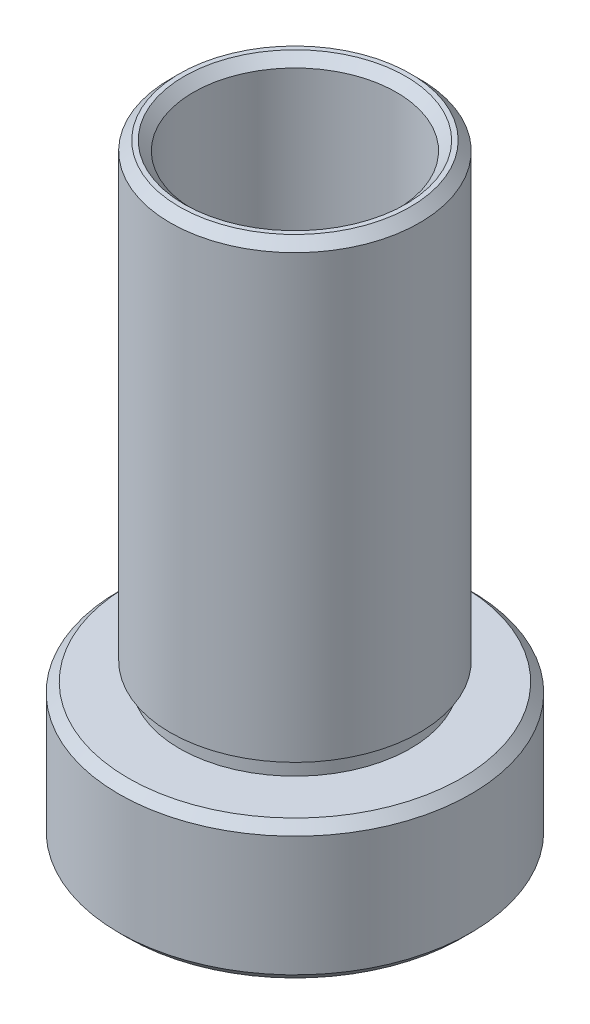
ISO-10303-21;
HEADER;
FILE_DESCRIPTION(('STEP AP214'),'2;1');
FILE_NAME('part.step','',(''),(''),'','','');
FILE_SCHEMA(('AUTOMOTIVE_DESIGN { 1 0 10303 214 1 1 1 1 }'));
ENDSEC;
DATA;
#1=APPLICATION_CONTEXT('core data for automotive mechanical design processes');
#2=APPLICATION_PROTOCOL_DEFINITION('international standard','automotive_design',2000,#1);
#3=PRODUCT_CONTEXT('',#1,'mechanical');
#4=PRODUCT('Part','Part','',(#3));
#5=PRODUCT_RELATED_PRODUCT_CATEGORY('part','',(#4));
#6=PRODUCT_DEFINITION_FORMATION('','',#4);
#7=PRODUCT_DEFINITION_CONTEXT('part definition',#1,'design');
#8=PRODUCT_DEFINITION('design','',#6,#7);
#9=PRODUCT_DEFINITION_SHAPE('','',#8);
#10=(LENGTH_UNIT() NAMED_UNIT(*) SI_UNIT(.MILLI.,.METRE.));
#11=(NAMED_UNIT(*) PLANE_ANGLE_UNIT() SI_UNIT($,.RADIAN.));
#12=(NAMED_UNIT(*) SI_UNIT($,.STERADIAN.) SOLID_ANGLE_UNIT());
#13=UNCERTAINTY_MEASURE_WITH_UNIT(LENGTH_MEASURE(1.E-05),#10,'distance_accuracy_value','');
#14=(GEOMETRIC_REPRESENTATION_CONTEXT(3) GLOBAL_UNCERTAINTY_ASSIGNED_CONTEXT((#13)) GLOBAL_UNIT_ASSIGNED_CONTEXT((#10,
#11,#12)) REPRESENTATION_CONTEXT('',''));
#15=CARTESIAN_POINT('',(0.,0.,0.));
#16=DIRECTION('',(0.,0.,1.));
#17=DIRECTION('',(1.,0.,0.));
#18=AXIS2_PLACEMENT_3D('',#15,#16,#17);
#19=CARTESIAN_POINT('',(6.75,2.64285417456689,0.));
#20=DIRECTION('',(0.,1.,0.));
#21=DIRECTION('',(0.,0.,1.));
#22=AXIS2_PLACEMENT_3D('',#19,#20,#21);
#23=PLANE('',#22);
#24=CARTESIAN_POINT('',(0.,2.6428541745669,0.));
#25=DIRECTION('',(0.,1.,0.));
#26=DIRECTION('',(0.,0.,1.));
#27=AXIS2_PLACEMENT_3D('',#24,#25,#26);
#28=CIRCLE('',#27,6.75);
#29=CARTESIAN_POINT('',(0.,2.6428541745669,6.75));
#30=VERTEX_POINT('',#29);
#31=EDGE_CURVE('E10',#30,#30,#28,.T.);
#32=ORIENTED_EDGE('',*,*,#31,.F.);
#33=EDGE_LOOP('',(#32));
#34=FACE_BOUND('',#33,.T.);
#35=CARTESIAN_POINT('',(0.,2.6428541745669,0.));
#36=DIRECTION('',(0.,1.,0.));
#37=DIRECTION('',(0.,0.,1.));
#38=AXIS2_PLACEMENT_3D('',#35,#36,#37);
#39=CIRCLE('',#38,6.25000000000001);
#40=CARTESIAN_POINT('',(0.,2.6428541745669,6.25000000000001));
#41=VERTEX_POINT('',#40);
#42=EDGE_CURVE('E94',#41,#41,#39,.T.);
#43=ORIENTED_EDGE('',*,*,#42,.T.);
#44=EDGE_LOOP('',(#43));
#45=FACE_BOUND('',#44,.T.);
#46=ADVANCED_FACE('F39',(#34,#45),#23,.F.);
#47=CARTESIAN_POINT('',(0.,44.5985977452931,0.));
#48=DIRECTION('',(0.,1.,0.));
#49=DIRECTION('',(0.,0.,1.));
#50=AXIS2_PLACEMENT_3D('',#47,#48,#49);
#51=CYLINDRICAL_SURFACE('',#50,6.75);
#52=CARTESIAN_POINT('',(0.,26.5428541745669,0.));
#53=DIRECTION('',(0.,1.,0.));
#54=DIRECTION('',(0.,0.,1.));
#55=AXIS2_PLACEMENT_3D('',#52,#53,#54);
#56=CIRCLE('',#55,6.75);
#57=CARTESIAN_POINT('',(0.,26.5428541745669,6.75));
#58=VERTEX_POINT('',#57);
#59=EDGE_CURVE('E45',#58,#58,#56,.T.);
#60=ORIENTED_EDGE('',*,*,#59,.F.);
#61=EDGE_LOOP('',(#60));
#62=FACE_BOUND('',#61,.T.);
#63=ORIENTED_EDGE('',*,*,#31,.T.);
#64=EDGE_LOOP('',(#63));
#65=FACE_BOUND('',#64,.T.);
#66=ADVANCED_FACE('F185',(#62,#65),#51,.T.);
#67=CARTESIAN_POINT('',(0.,26.5428541745669,0.));
#68=DIRECTION('',(0.,-1.,0.));
#69=DIRECTION('',(0.,0.,-1.));
#70=AXIS2_PLACEMENT_3D('',#67,#68,#69);
#71=CONICAL_SURFACE('',#70,6.75,0.785398163397445);
#72=CARTESIAN_POINT('',(0.,27.0428541745669,0.));
#73=DIRECTION('',(0.,1.,0.));
#74=DIRECTION('',(0.,0.,1.));
#75=AXIS2_PLACEMENT_3D('',#72,#73,#74);
#76=CIRCLE('',#75,6.25);
#77=CARTESIAN_POINT('',(0.,27.0428541745669,6.25));
#78=VERTEX_POINT('',#77);
#79=EDGE_CURVE('E49',#78,#78,#76,.T.);
#80=ORIENTED_EDGE('',*,*,#79,.F.);
#81=EDGE_LOOP('',(#80));
#82=FACE_BOUND('',#81,.T.);
#83=ORIENTED_EDGE('',*,*,#59,.T.);
#84=EDGE_LOOP('',(#83));
#85=FACE_BOUND('',#84,.T.);
#86=ADVANCED_FACE('F180',(#82,#85),#71,.T.);
#87=CARTESIAN_POINT('',(6.00000000000001,27.0428541745669,0.));
#88=DIRECTION('',(0.,-1.,0.));
#89=DIRECTION('',(0.,0.,-1.));
#90=AXIS2_PLACEMENT_3D('',#87,#88,#89);
#91=PLANE('',#90);
#92=CARTESIAN_POINT('',(0.,27.0428541745669,0.));
#93=DIRECTION('',(0.,1.,0.));
#94=DIRECTION('',(0.,0.,1.));
#95=AXIS2_PLACEMENT_3D('',#92,#93,#94);
#96=CIRCLE('',#95,6.00000000000001);
#97=CARTESIAN_POINT('',(0.,27.0428541745669,6.00000000000001));
#98=VERTEX_POINT('',#97);
#99=EDGE_CURVE('E53',#98,#98,#96,.T.);
#100=ORIENTED_EDGE('',*,*,#99,.F.);
#101=EDGE_LOOP('',(#100));
#102=FACE_BOUND('',#101,.T.);
#103=ORIENTED_EDGE('',*,*,#79,.T.);
#104=EDGE_LOOP('',(#103));
#105=FACE_BOUND('',#104,.T.);
#106=ADVANCED_FACE('F174',(#102,#105),#91,.F.);
#107=CARTESIAN_POINT('',(0.,27.0428541745669,0.));
#108=DIRECTION('',(0.,1.,0.));
#109=DIRECTION('',(0.,0.,1.));
#110=AXIS2_PLACEMENT_3D('',#107,#108,#109);
#111=CONICAL_SURFACE('',#110,6.00000000000001,0.785398163397448);
#112=CARTESIAN_POINT('',(0.,26.5428541745669,0.));
#113=DIRECTION('',(0.,1.,0.));
#114=DIRECTION('',(0.,0.,1.));
#115=AXIS2_PLACEMENT_3D('',#112,#113,#114);
#116=CIRCLE('',#115,5.50000000000001);
#117=CARTESIAN_POINT('',(0.,26.5428541745669,5.50000000000001));
#118=VERTEX_POINT('',#117);
#119=EDGE_CURVE('E58',#118,#118,#116,.T.);
#120=ORIENTED_EDGE('',*,*,#119,.F.);
#121=EDGE_LOOP('',(#120));
#122=FACE_BOUND('',#121,.T.);
#123=ORIENTED_EDGE('',*,*,#99,.T.);
#124=EDGE_LOOP('',(#123));
#125=FACE_BOUND('',#124,.T.);
#126=ADVANCED_FACE('F168',(#122,#125),#111,.F.);
#127=CARTESIAN_POINT('',(0.,44.5985977452931,0.));
#128=DIRECTION('',(0.,1.,0.));
#129=DIRECTION('',(0.,0.,1.));
#130=AXIS2_PLACEMENT_3D('',#127,#128,#129);
#131=CYLINDRICAL_SURFACE('',#130,5.50000000000001);
#132=CARTESIAN_POINT('',(0.,-0.357145825433107,0.));
#133=DIRECTION('',(0.,1.,0.));
#134=DIRECTION('',(0.,0.,1.));
#135=AXIS2_PLACEMENT_3D('',#132,#133,#134);
#136=CIRCLE('',#135,5.50000000000001);
#137=CARTESIAN_POINT('',(0.,-0.357145825433107,5.50000000000001));
#138=VERTEX_POINT('',#137);
#139=EDGE_CURVE('E61',#138,#138,#136,.T.);
#140=ORIENTED_EDGE('',*,*,#139,.F.);
#141=EDGE_LOOP('',(#140));
#142=FACE_BOUND('',#141,.T.);
#143=ORIENTED_EDGE('',*,*,#119,.T.);
#144=EDGE_LOOP('',(#143));
#145=FACE_BOUND('',#144,.T.);
#146=ADVANCED_FACE('F162',(#142,#145),#131,.F.);
#147=CARTESIAN_POINT('',(7.6,-0.357145825433106,0.));
#148=DIRECTION('',(0.,1.,0.));
#149=DIRECTION('',(0.,0.,1.));
#150=AXIS2_PLACEMENT_3D('',#147,#148,#149);
#151=PLANE('',#150);
#152=CARTESIAN_POINT('',(0.,-0.357145825433107,0.));
#153=DIRECTION('',(0.,1.,0.));
#154=DIRECTION('',(0.,0.,1.));
#155=AXIS2_PLACEMENT_3D('',#152,#153,#154);
#156=CIRCLE('',#155,7.6);
#157=CARTESIAN_POINT('',(0.,-0.357145825433107,7.6));
#158=VERTEX_POINT('',#157);
#159=EDGE_CURVE('E64',#158,#158,#156,.T.);
#160=ORIENTED_EDGE('',*,*,#159,.F.);
#161=EDGE_LOOP('',(#160));
#162=FACE_BOUND('',#161,.T.);
#163=ORIENTED_EDGE('',*,*,#139,.T.);
#164=EDGE_LOOP('',(#163));
#165=FACE_BOUND('',#164,.T.);
#166=ADVANCED_FACE('F156',(#162,#165),#151,.F.);
#167=CARTESIAN_POINT('',(0.,44.5985977452931,0.));
#168=DIRECTION('',(0.,1.,0.));
#169=DIRECTION('',(0.,0.,1.));
#170=AXIS2_PLACEMENT_3D('',#167,#168,#169);
#171=CYLINDRICAL_SURFACE('',#170,7.6);
#172=CARTESIAN_POINT('',(0.,-1.35714582543311,0.));
#173=DIRECTION('',(0.,1.,0.));
#174=DIRECTION('',(0.,0.,1.));
#175=AXIS2_PLACEMENT_3D('',#172,#173,#174);
#176=CIRCLE('',#175,7.6);
#177=CARTESIAN_POINT('',(0.,-1.35714582543311,7.6));
#178=VERTEX_POINT('',#177);
#179=EDGE_CURVE('E67',#178,#178,#176,.T.);
#180=ORIENTED_EDGE('',*,*,#179,.F.);
#181=EDGE_LOOP('',(#180));
#182=FACE_BOUND('',#181,.T.);
#183=ORIENTED_EDGE('',*,*,#159,.T.);
#184=EDGE_LOOP('',(#183));
#185=FACE_BOUND('',#184,.T.);
#186=ADVANCED_FACE('F150',(#182,#185),#171,.F.);
#187=CARTESIAN_POINT('',(7.50000000000001,-1.35714582543311,0.));
#188=DIRECTION('',(0.,-1.,0.));
#189=DIRECTION('',(0.,0.,-1.));
#190=AXIS2_PLACEMENT_3D('',#187,#188,#189);
#191=PLANE('',#190);
#192=CARTESIAN_POINT('',(0.,-1.35714582543311,0.));
#193=DIRECTION('',(0.,1.,0.));
#194=DIRECTION('',(0.,0.,1.));
#195=AXIS2_PLACEMENT_3D('',#192,#193,#194);
#196=CIRCLE('',#195,7.50000000000001);
#197=CARTESIAN_POINT('',(0.,-1.35714582543311,7.50000000000001));
#198=VERTEX_POINT('',#197);
#199=EDGE_CURVE('E70',#198,#198,#196,.T.);
#200=ORIENTED_EDGE('',*,*,#199,.F.);
#201=EDGE_LOOP('',(#200));
#202=FACE_BOUND('',#201,.T.);
#203=ORIENTED_EDGE('',*,*,#179,.T.);
#204=EDGE_LOOP('',(#203));
#205=FACE_BOUND('',#204,.T.);
#206=ADVANCED_FACE('F144',(#202,#205),#191,.F.);
#207=CARTESIAN_POINT('',(0.,44.5985977452931,0.));
#208=DIRECTION('',(0.,1.,0.));
#209=DIRECTION('',(0.,0.,1.));
#210=AXIS2_PLACEMENT_3D('',#207,#208,#209);
#211=CYLINDRICAL_SURFACE('',#210,7.50000000000001);
#212=CARTESIAN_POINT('',(0.,-5.3571458254331,0.));
#213=DIRECTION('',(0.,1.,0.));
#214=DIRECTION('',(0.,0.,1.));
#215=AXIS2_PLACEMENT_3D('',#212,#213,#214);
#216=CIRCLE('',#215,7.50000000000001);
#217=CARTESIAN_POINT('',(0.,-5.3571458254331,7.50000000000001));
#218=VERTEX_POINT('',#217);
#219=EDGE_CURVE('E73',#218,#218,#216,.T.);
#220=ORIENTED_EDGE('',*,*,#219,.F.);
#221=EDGE_LOOP('',(#220));
#222=FACE_BOUND('',#221,.T.);
#223=ORIENTED_EDGE('',*,*,#199,.T.);
#224=EDGE_LOOP('',(#223));
#225=FACE_BOUND('',#224,.T.);
#226=ADVANCED_FACE('F138',(#222,#225),#211,.F.);
#227=CARTESIAN_POINT('',(0.,-5.3571458254331,0.));
#228=DIRECTION('',(0.,-1.,0.));
#229=DIRECTION('',(0.,0.,-1.));
#230=AXIS2_PLACEMENT_3D('',#227,#228,#229);
#231=CONICAL_SURFACE('',#230,7.50000000000001,0.785398163397447);
#232=CARTESIAN_POINT('',(0.,-5.85714582543311,0.));
#233=DIRECTION('',(0.,1.,0.));
#234=DIRECTION('',(0.,0.,1.));
#235=AXIS2_PLACEMENT_3D('',#232,#233,#234);
#236=CIRCLE('',#235,8.00000000000001);
#237=CARTESIAN_POINT('',(0.,-5.85714582543311,8.00000000000001));
#238=VERTEX_POINT('',#237);
#239=EDGE_CURVE('E76',#238,#238,#236,.T.);
#240=ORIENTED_EDGE('',*,*,#239,.F.);
#241=EDGE_LOOP('',(#240));
#242=FACE_BOUND('',#241,.T.);
#243=ORIENTED_EDGE('',*,*,#219,.T.);
#244=EDGE_LOOP('',(#243));
#245=FACE_BOUND('',#244,.T.);
#246=ADVANCED_FACE('F132',(#242,#245),#231,.F.);
#247=CARTESIAN_POINT('',(9.02500000000001,-5.85714582543311,0.));
#248=DIRECTION('',(0.,1.,0.));
#249=DIRECTION('',(0.,0.,1.));
#250=AXIS2_PLACEMENT_3D('',#247,#248,#249);
#251=PLANE('',#250);
#252=CARTESIAN_POINT('',(0.,-5.85714582543311,0.));
#253=DIRECTION('',(0.,1.,0.));
#254=DIRECTION('',(0.,0.,1.));
#255=AXIS2_PLACEMENT_3D('',#252,#253,#254);
#256=CIRCLE('',#255,9.02500000000001);
#257=CARTESIAN_POINT('',(0.,-5.85714582543311,9.02500000000001));
#258=VERTEX_POINT('',#257);
#259=EDGE_CURVE('E79',#258,#258,#256,.T.);
#260=ORIENTED_EDGE('',*,*,#259,.F.);
#261=EDGE_LOOP('',(#260));
#262=FACE_BOUND('',#261,.T.);
#263=ORIENTED_EDGE('',*,*,#239,.T.);
#264=EDGE_LOOP('',(#263));
#265=FACE_BOUND('',#264,.T.);
#266=ADVANCED_FACE('F126',(#262,#265),#251,.F.);
#267=CARTESIAN_POINT('',(0.,-5.85714582543311,0.));
#268=DIRECTION('',(0.,1.,0.));
#269=DIRECTION('',(0.,0.,1.));
#270=AXIS2_PLACEMENT_3D('',#267,#268,#269);
#271=CONICAL_SURFACE('',#270,9.02500000000001,0.78539816339745);
#272=CARTESIAN_POINT('',(0.,-5.3571458254331,0.));
#273=DIRECTION('',(0.,1.,0.));
#274=DIRECTION('',(0.,0.,1.));
#275=AXIS2_PLACEMENT_3D('',#272,#273,#274);
#276=CIRCLE('',#275,9.52500000000001);
#277=CARTESIAN_POINT('',(0.,-5.3571458254331,9.52500000000001));
#278=VERTEX_POINT('',#277);
#279=EDGE_CURVE('E82',#278,#278,#276,.T.);
#280=ORIENTED_EDGE('',*,*,#279,.F.);
#281=EDGE_LOOP('',(#280));
#282=FACE_BOUND('',#281,.T.);
#283=ORIENTED_EDGE('',*,*,#259,.T.);
#284=EDGE_LOOP('',(#283));
#285=FACE_BOUND('',#284,.T.);
#286=ADVANCED_FACE('F120',(#282,#285),#271,.T.);
#287=CARTESIAN_POINT('',(0.,44.5985977452931,0.));
#288=DIRECTION('',(0.,1.,0.));
#289=DIRECTION('',(0.,0.,1.));
#290=AXIS2_PLACEMENT_3D('',#287,#288,#289);
#291=CYLINDRICAL_SURFACE('',#290,9.52500000000001);
#292=CARTESIAN_POINT('',(0.,1.14285417456689,0.));
#293=DIRECTION('',(0.,1.,0.));
#294=DIRECTION('',(0.,0.,1.));
#295=AXIS2_PLACEMENT_3D('',#292,#293,#294);
#296=CIRCLE('',#295,9.525);
#297=CARTESIAN_POINT('',(0.,1.14285417456689,9.525));
#298=VERTEX_POINT('',#297);
#299=EDGE_CURVE('E85',#298,#298,#296,.T.);
#300=ORIENTED_EDGE('',*,*,#299,.F.);
#301=EDGE_LOOP('',(#300));
#302=FACE_BOUND('',#301,.T.);
#303=ORIENTED_EDGE('',*,*,#279,.T.);
#304=EDGE_LOOP('',(#303));
#305=FACE_BOUND('',#304,.T.);
#306=ADVANCED_FACE('F114',(#302,#305),#291,.T.);
#307=CARTESIAN_POINT('',(0.,1.14285417456689,0.));
#308=DIRECTION('',(0.,-1.,0.));
#309=DIRECTION('',(0.,0.,-1.));
#310=AXIS2_PLACEMENT_3D('',#307,#308,#309);
#311=CONICAL_SURFACE('',#310,9.525,0.785398163397447);
#312=CARTESIAN_POINT('',(0.,1.64285417456689,0.));
#313=DIRECTION('',(0.,1.,0.));
#314=DIRECTION('',(0.,0.,1.));
#315=AXIS2_PLACEMENT_3D('',#312,#313,#314);
#316=CIRCLE('',#315,9.02500000000001);
#317=CARTESIAN_POINT('',(0.,1.64285417456689,9.02500000000001));
#318=VERTEX_POINT('',#317);
#319=EDGE_CURVE('E88',#318,#318,#316,.T.);
#320=ORIENTED_EDGE('',*,*,#319,.F.);
#321=EDGE_LOOP('',(#320));
#322=FACE_BOUND('',#321,.T.);
#323=ORIENTED_EDGE('',*,*,#299,.T.);
#324=EDGE_LOOP('',(#323));
#325=FACE_BOUND('',#324,.T.);
#326=ADVANCED_FACE('F108',(#322,#325),#311,.T.);
#327=CARTESIAN_POINT('',(6.25000000000001,1.64285417456689,0.));
#328=DIRECTION('',(0.,-1.,0.));
#329=DIRECTION('',(0.,0.,-1.));
#330=AXIS2_PLACEMENT_3D('',#327,#328,#329);
#331=PLANE('',#330);
#332=CARTESIAN_POINT('',(0.,1.64285417456689,0.));
#333=DIRECTION('',(0.,1.,0.));
#334=DIRECTION('',(0.,0.,1.));
#335=AXIS2_PLACEMENT_3D('',#332,#333,#334);
#336=CIRCLE('',#335,6.25000000000001);
#337=CARTESIAN_POINT('',(0.,1.64285417456689,6.25000000000001));
#338=VERTEX_POINT('',#337);
#339=EDGE_CURVE('E91',#338,#338,#336,.T.);
#340=ORIENTED_EDGE('',*,*,#339,.F.);
#341=EDGE_LOOP('',(#340));
#342=FACE_BOUND('',#341,.T.);
#343=ORIENTED_EDGE('',*,*,#319,.T.);
#344=EDGE_LOOP('',(#343));
#345=FACE_BOUND('',#344,.T.);
#346=ADVANCED_FACE('F102',(#342,#345),#331,.F.);
#347=CARTESIAN_POINT('',(0.,44.5985977452931,0.));
#348=DIRECTION('',(0.,1.,0.));
#349=DIRECTION('',(0.,0.,1.));
#350=AXIS2_PLACEMENT_3D('',#347,#348,#349);
#351=CYLINDRICAL_SURFACE('',#350,6.25000000000001);
#352=ORIENTED_EDGE('',*,*,#42,.F.);
#353=EDGE_LOOP('',(#352));
#354=FACE_BOUND('',#353,.T.);
#355=ORIENTED_EDGE('',*,*,#339,.T.);
#356=EDGE_LOOP('',(#355));
#357=FACE_BOUND('',#356,.T.);
#358=ADVANCED_FACE('F99',(#354,#357),#351,.T.);
#359=CLOSED_SHELL('',(#46,#66,#86,#106,#126,#146,#166,#186,#206,#226,#246,#266,#286,#306,#326,
#346,#358));
#360=MANIFOLD_SOLID_BREP('B2',#359);
#361=ADVANCED_BREP_SHAPE_REPRESENTATION('',(#18,#360),#14);
#362=SHAPE_DEFINITION_REPRESENTATION(#9,#361);
ENDSEC;
END-ISO-10303-21;
